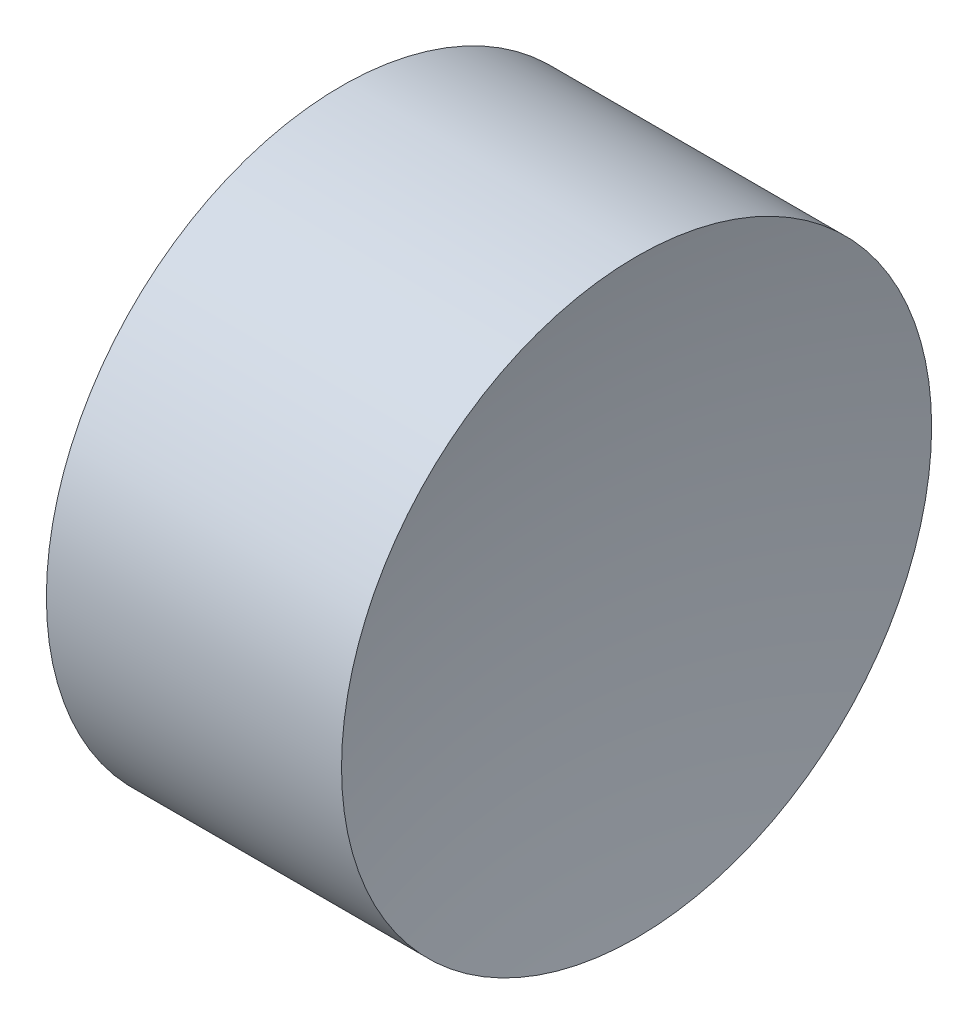
ISO-10303-21;
HEADER;
FILE_DESCRIPTION(('STEP AP214'),'2;1');
FILE_NAME('part.step','',(''),(''),'','','');
FILE_SCHEMA(('AUTOMOTIVE_DESIGN { 1 0 10303 214 1 1 1 1 }'));
ENDSEC;
DATA;
#1=APPLICATION_CONTEXT('core data for automotive mechanical design processes');
#2=APPLICATION_PROTOCOL_DEFINITION('international standard','automotive_design',2000,#1);
#3=PRODUCT_CONTEXT('',#1,'mechanical');
#4=PRODUCT('Part','Part','',(#3));
#5=PRODUCT_RELATED_PRODUCT_CATEGORY('part','',(#4));
#6=PRODUCT_DEFINITION_FORMATION('','',#4);
#7=PRODUCT_DEFINITION_CONTEXT('part definition',#1,'design');
#8=PRODUCT_DEFINITION('design','',#6,#7);
#9=PRODUCT_DEFINITION_SHAPE('','',#8);
#10=(LENGTH_UNIT() NAMED_UNIT(*) SI_UNIT(.MILLI.,.METRE.));
#11=(NAMED_UNIT(*) PLANE_ANGLE_UNIT() SI_UNIT($,.RADIAN.));
#12=(NAMED_UNIT(*) SI_UNIT($,.STERADIAN.) SOLID_ANGLE_UNIT());
#13=UNCERTAINTY_MEASURE_WITH_UNIT(LENGTH_MEASURE(1.E-05),#10,'distance_accuracy_value','');
#14=(GEOMETRIC_REPRESENTATION_CONTEXT(3) GLOBAL_UNCERTAINTY_ASSIGNED_CONTEXT((#13)) GLOBAL_UNIT_ASSIGNED_CONTEXT((#10,
#11,#12)) REPRESENTATION_CONTEXT('',''));
#15=CARTESIAN_POINT('',(0.,0.,0.));
#16=DIRECTION('',(0.,0.,1.));
#17=DIRECTION('',(1.,0.,0.));
#18=AXIS2_PLACEMENT_3D('',#15,#16,#17);
#19=CARTESIAN_POINT('',(22.030595084783,6.51556304570152,0.));
#20=DIRECTION('',(-1.,0.,0.));
#21=DIRECTION('',(0.,-1.,0.));
#22=AXIS2_PLACEMENT_3D('',#19,#20,#21);
#23=SPHERICAL_SURFACE('',#22,9.17);
#24=CARTESIAN_POINT('',(13.0813548935712,6.51556304570152,0.));
#25=DIRECTION('',(-1.,0.,0.));
#26=DIRECTION('',(0.,0.,1.));
#27=AXIS2_PLACEMENT_3D('',#24,#25,#26);
#28=CIRCLE('',#27,2.);
#29=CARTESIAN_POINT('',(13.0813548935712,6.51556304570152,2.));
#30=VERTEX_POINT('',#29);
#31=EDGE_CURVE('E10',#30,#30,#28,.T.);
#32=ORIENTED_EDGE('',*,*,#31,.F.);
#33=EDGE_LOOP('',(#32));
#34=FACE_BOUND('',#33,.T.);
#35=ADVANCED_FACE('F35',(#34),#23,.F.);
#36=CARTESIAN_POINT('',(10.5782359612221,6.51556304570152,0.));
#37=DIRECTION('',(-1.,0.,0.));
#38=DIRECTION('',(0.,0.,1.));
#39=AXIS2_PLACEMENT_3D('',#36,#37,#38);
#40=CYLINDRICAL_SURFACE('',#39,2.);
#41=CARTESIAN_POINT('',(11.080595084783,6.51556304570152,0.));
#42=DIRECTION('',(-1.,0.,0.));
#43=DIRECTION('',(0.,0.,1.));
#44=AXIS2_PLACEMENT_3D('',#41,#42,#43);
#45=CIRCLE('',#44,2.);
#46=CARTESIAN_POINT('',(11.080595084783,6.51556304570152,2.));
#47=VERTEX_POINT('',#46);
#48=EDGE_CURVE('E41',#47,#47,#45,.T.);
#49=ORIENTED_EDGE('',*,*,#48,.F.);
#50=EDGE_LOOP('',(#49));
#51=FACE_BOUND('',#50,.T.);
#52=ORIENTED_EDGE('',*,*,#31,.T.);
#53=EDGE_LOOP('',(#52));
#54=FACE_BOUND('',#53,.T.);
#55=ADVANCED_FACE('F49',(#51,#54),#40,.T.);
#56=CARTESIAN_POINT('',(11.080595084783,6.51556304570152,0.));
#57=DIRECTION('',(1.,0.,0.));
#58=DIRECTION('',(0.,0.,-1.));
#59=AXIS2_PLACEMENT_3D('',#56,#57,#58);
#60=PLANE('',#59);
#61=ORIENTED_EDGE('',*,*,#48,.T.);
#62=EDGE_LOOP('',(#61));
#63=FACE_BOUND('',#62,.T.);
#64=ADVANCED_FACE('F47',(#63),#60,.F.);
#65=CLOSED_SHELL('',(#35,#55,#64));
#66=MANIFOLD_SOLID_BREP('B2',#65);
#67=ADVANCED_BREP_SHAPE_REPRESENTATION('',(#18,#66),#14);
#68=SHAPE_DEFINITION_REPRESENTATION(#9,#67);
ENDSEC;
END-ISO-10303-21;
